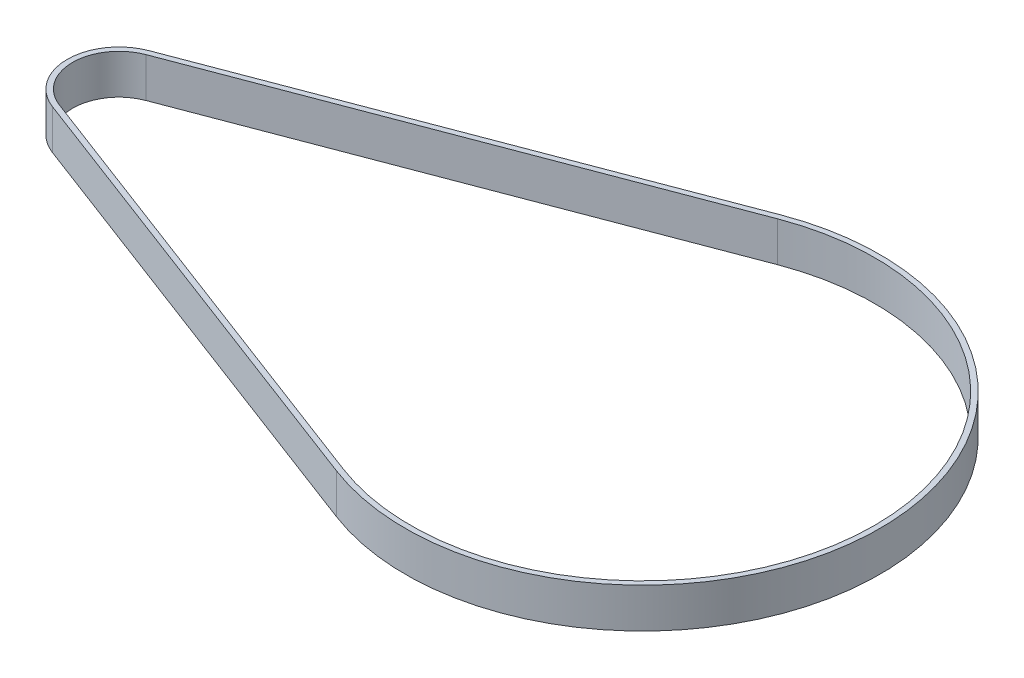
ISO-10303-21;
HEADER;
FILE_DESCRIPTION(('STEP AP214'),'2;1');
FILE_NAME('part.step','',(''),(''),'','','');
FILE_SCHEMA(('AUTOMOTIVE_DESIGN { 1 0 10303 214 1 1 1 1 }'));
ENDSEC;
DATA;
#1=APPLICATION_CONTEXT('core data for automotive mechanical design processes');
#2=APPLICATION_PROTOCOL_DEFINITION('international standard','automotive_design',2000,#1);
#3=PRODUCT_CONTEXT('',#1,'mechanical');
#4=PRODUCT('Part','Part','',(#3));
#5=PRODUCT_RELATED_PRODUCT_CATEGORY('part','',(#4));
#6=PRODUCT_DEFINITION_FORMATION('','',#4);
#7=PRODUCT_DEFINITION_CONTEXT('part definition',#1,'design');
#8=PRODUCT_DEFINITION('design','',#6,#7);
#9=PRODUCT_DEFINITION_SHAPE('','',#8);
#10=(LENGTH_UNIT() NAMED_UNIT(*) SI_UNIT(.MILLI.,.METRE.));
#11=(NAMED_UNIT(*) PLANE_ANGLE_UNIT() SI_UNIT($,.RADIAN.));
#12=(NAMED_UNIT(*) SI_UNIT($,.STERADIAN.) SOLID_ANGLE_UNIT());
#13=UNCERTAINTY_MEASURE_WITH_UNIT(LENGTH_MEASURE(1.E-05),#10,'distance_accuracy_value','');
#14=(GEOMETRIC_REPRESENTATION_CONTEXT(3) GLOBAL_UNCERTAINTY_ASSIGNED_CONTEXT((#13)) GLOBAL_UNIT_ASSIGNED_CONTEXT((#10,
#11,#12)) REPRESENTATION_CONTEXT('',''));
#15=CARTESIAN_POINT('',(0.,0.,0.));
#16=DIRECTION('',(0.,0.,1.));
#17=DIRECTION('',(1.,0.,0.));
#18=AXIS2_PLACEMENT_3D('',#15,#16,#17);
#19=CARTESIAN_POINT('',(-79.,6.,0.));
#20=DIRECTION('',(0.,1.,0.));
#21=DIRECTION('',(0.,0.,1.));
#22=AXIS2_PLACEMENT_3D('',#19,#20,#21);
#23=PLANE('',#22);
#24=CARTESIAN_POINT('',(-79.,6.,0.));
#25=DIRECTION('',(0.,1.,0.));
#26=DIRECTION('',(0.,0.,1.));
#27=AXIS2_PLACEMENT_3D('',#24,#25,#26);
#28=CIRCLE('',#27,7.8);
#29=CARTESIAN_POINT('',(-81.7645569620253,6.,-7.29364276639028));
#30=VERTEX_POINT('',#29);
#31=CARTESIAN_POINT('',(-81.7645569620253,6.,7.29364276639028));
#32=VERTEX_POINT('',#31);
#33=EDGE_CURVE('E133',#30,#32,#28,.T.);
#34=ORIENTED_EDGE('',*,*,#33,.T.);
#35=DIRECTION('',(0.935082405947472,0.,0.354430379746835));
#36=VECTOR('',#35,1.);
#37=CARTESIAN_POINT('',(-81.7645569620253,6.,7.29364276639028));
#38=LINE('',#37,#36);
#39=CARTESIAN_POINT('',(-12.6886075949367,6.,33.4759501329195));
#40=VERTEX_POINT('',#39);
#41=EDGE_CURVE('E136',#32,#40,#38,.T.);
#42=ORIENTED_EDGE('',*,*,#41,.T.);
#43=CARTESIAN_POINT('',(0.,6.,0.));
#44=DIRECTION('',(0.,1.,0.));
#45=DIRECTION('',(0.,0.,1.));
#46=AXIS2_PLACEMENT_3D('',#43,#44,#45);
#47=CIRCLE('',#46,35.8);
#48=CARTESIAN_POINT('',(-12.6886075949367,6.,-33.4759501329195));
#49=VERTEX_POINT('',#48);
#50=EDGE_CURVE('E139',#40,#49,#47,.T.);
#51=ORIENTED_EDGE('',*,*,#50,.T.);
#52=DIRECTION('',(-0.935082405947473,0.,0.354430379746836));
#53=VECTOR('',#52,1.);
#54=CARTESIAN_POINT('',(-81.7645569620253,6.,-7.29364276639028));
#55=LINE('',#54,#53);
#56=EDGE_CURVE('E141',#49,#30,#55,.T.);
#57=ORIENTED_EDGE('',*,*,#56,.T.);
#58=EDGE_LOOP('',(#34,#42,#51,#57));
#59=FACE_BOUND('',#58,.T.);
#60=DIRECTION('',(0.935082405947472,0.,0.354430379746836));
#61=VECTOR('',#60,1.);
#62=CARTESIAN_POINT('',(-81.4810126582279,6.,6.54557684163231));
#63=LINE('',#62,#61);
#64=CARTESIAN_POINT('',(-81.4810126582279,6.,6.54557684163231));
#65=VERTEX_POINT('',#64);
#66=CARTESIAN_POINT('',(-12.4050632911392,6.,32.7278842081616));
#67=VERTEX_POINT('',#66);
#68=EDGE_CURVE('E105',#65,#67,#63,.T.);
#69=ORIENTED_EDGE('',*,*,#68,.F.);
#70=CARTESIAN_POINT('',(-79.,6.,0.));
#71=DIRECTION('',(0.,1.,0.));
#72=DIRECTION('',(0.,0.,1.));
#73=AXIS2_PLACEMENT_3D('',#70,#71,#72);
#74=CIRCLE('',#73,7.);
#75=CARTESIAN_POINT('',(-81.4810126582279,6.,-6.5455768416323));
#76=VERTEX_POINT('',#75);
#77=EDGE_CURVE('E97',#76,#65,#74,.T.);
#78=ORIENTED_EDGE('',*,*,#77,.F.);
#79=DIRECTION('',(-0.935082405947473,0.,0.354430379746835));
#80=VECTOR('',#79,1.);
#81=CARTESIAN_POINT('',(-81.4810126582279,6.,-6.5455768416323));
#82=LINE('',#81,#80);
#83=CARTESIAN_POINT('',(-12.4050632911392,6.,-32.7278842081615));
#84=VERTEX_POINT('',#83);
#85=EDGE_CURVE('E119',#84,#76,#82,.T.);
#86=ORIENTED_EDGE('',*,*,#85,.F.);
#87=CARTESIAN_POINT('',(0.,6.,0.));
#88=DIRECTION('',(0.,1.,0.));
#89=DIRECTION('',(0.,0.,1.));
#90=AXIS2_PLACEMENT_3D('',#87,#88,#89);
#91=CIRCLE('',#90,35.);
#92=EDGE_CURVE('E117',#67,#84,#91,.T.);
#93=ORIENTED_EDGE('',*,*,#92,.F.);
#94=EDGE_LOOP('',(#69,#78,#86,#93));
#95=FACE_BOUND('',#94,.T.);
#96=ADVANCED_FACE('F32',(#59,#95),#23,.T.);
#97=CARTESIAN_POINT('',(-79.,0.,0.));
#98=DIRECTION('',(0.,1.,0.));
#99=DIRECTION('',(0.,0.,1.));
#100=AXIS2_PLACEMENT_3D('',#97,#98,#99);
#101=PLANE('',#100);
#102=CARTESIAN_POINT('',(-79.,0.,0.));
#103=DIRECTION('',(0.,1.,0.));
#104=DIRECTION('',(0.,0.,1.));
#105=AXIS2_PLACEMENT_3D('',#102,#103,#104);
#106=CIRCLE('',#105,7.8);
#107=CARTESIAN_POINT('',(-81.7645569620253,0.,-7.29364276639028));
#108=VERTEX_POINT('',#107);
#109=CARTESIAN_POINT('',(-81.7645569620253,0.,7.29364276639028));
#110=VERTEX_POINT('',#109);
#111=EDGE_CURVE('E113',#108,#110,#106,.T.);
#112=ORIENTED_EDGE('',*,*,#111,.F.);
#113=DIRECTION('',(-0.935082405947473,0.,0.354430379746836));
#114=VECTOR('',#113,1.);
#115=CARTESIAN_POINT('',(-81.7645569620253,0.,-7.29364276639028));
#116=LINE('',#115,#114);
#117=CARTESIAN_POINT('',(-12.6886075949367,0.,-33.4759501329195));
#118=VERTEX_POINT('',#117);
#119=EDGE_CURVE('E137',#118,#108,#116,.T.);
#120=ORIENTED_EDGE('',*,*,#119,.F.);
#121=CARTESIAN_POINT('',(0.,0.,0.));
#122=DIRECTION('',(0.,1.,0.));
#123=DIRECTION('',(0.,0.,1.));
#124=AXIS2_PLACEMENT_3D('',#121,#122,#123);
#125=CIRCLE('',#124,35.8);
#126=CARTESIAN_POINT('',(-12.6886075949367,0.,33.4759501329195));
#127=VERTEX_POINT('',#126);
#128=EDGE_CURVE('E148',#127,#118,#125,.T.);
#129=ORIENTED_EDGE('',*,*,#128,.F.);
#130=DIRECTION('',(0.935082405947472,0.,0.354430379746835));
#131=VECTOR('',#130,1.);
#132=CARTESIAN_POINT('',(-81.7645569620253,0.,7.29364276639028));
#133=LINE('',#132,#131);
#134=EDGE_CURVE('E146',#110,#127,#133,.T.);
#135=ORIENTED_EDGE('',*,*,#134,.F.);
#136=EDGE_LOOP('',(#112,#120,#129,#135));
#137=FACE_BOUND('',#136,.T.);
#138=CARTESIAN_POINT('',(-79.,0.,0.));
#139=DIRECTION('',(0.,1.,0.));
#140=DIRECTION('',(0.,0.,1.));
#141=AXIS2_PLACEMENT_3D('',#138,#139,#140);
#142=CIRCLE('',#141,7.);
#143=CARTESIAN_POINT('',(-81.4810126582279,0.,-6.5455768416323));
#144=VERTEX_POINT('',#143);
#145=CARTESIAN_POINT('',(-81.4810126582279,0.,6.54557684163231));
#146=VERTEX_POINT('',#145);
#147=EDGE_CURVE('E55',#144,#146,#142,.T.);
#148=ORIENTED_EDGE('',*,*,#147,.T.);
#149=DIRECTION('',(0.935082405947472,0.,0.354430379746836));
#150=VECTOR('',#149,1.);
#151=CARTESIAN_POINT('',(-81.4810126582279,0.,6.54557684163231));
#152=LINE('',#151,#150);
#153=CARTESIAN_POINT('',(-12.4050632911392,0.,32.7278842081616));
#154=VERTEX_POINT('',#153);
#155=EDGE_CURVE('E112',#146,#154,#152,.T.);
#156=ORIENTED_EDGE('',*,*,#155,.T.);
#157=CARTESIAN_POINT('',(0.,0.,0.));
#158=DIRECTION('',(0.,1.,0.));
#159=DIRECTION('',(0.,0.,1.));
#160=AXIS2_PLACEMENT_3D('',#157,#158,#159);
#161=CIRCLE('',#160,35.);
#162=CARTESIAN_POINT('',(-12.4050632911392,0.,-32.7278842081616));
#163=VERTEX_POINT('',#162);
#164=EDGE_CURVE('E125',#154,#163,#161,.T.);
#165=ORIENTED_EDGE('',*,*,#164,.T.);
#166=DIRECTION('',(-0.935082405947473,0.,0.354430379746835));
#167=VECTOR('',#166,1.);
#168=CARTESIAN_POINT('',(-81.4810126582279,0.,-6.5455768416323));
#169=LINE('',#168,#167);
#170=EDGE_CURVE('E106',#163,#144,#169,.T.);
#171=ORIENTED_EDGE('',*,*,#170,.T.);
#172=EDGE_LOOP('',(#148,#156,#165,#171));
#173=FACE_BOUND('',#172,.T.);
#174=ADVANCED_FACE('F166',(#137,#173),#101,.F.);
#175=CARTESIAN_POINT('',(-79.,6.,0.));
#176=DIRECTION('',(0.,-1.,0.));
#177=DIRECTION('',(0.,0.,-1.));
#178=AXIS2_PLACEMENT_3D('',#175,#176,#177);
#179=CYLINDRICAL_SURFACE('',#178,7.8);
#180=ORIENTED_EDGE('',*,*,#111,.T.);
#181=DIRECTION('',(0.,-1.,0.));
#182=VECTOR('',#181,1.);
#183=CARTESIAN_POINT('',(-81.7645569620253,6.,7.29364276639028));
#184=LINE('',#183,#182);
#185=EDGE_CURVE('E11',#32,#110,#184,.T.);
#186=ORIENTED_EDGE('',*,*,#185,.F.);
#187=ORIENTED_EDGE('',*,*,#33,.F.);
#188=DIRECTION('',(0.,-1.,0.));
#189=VECTOR('',#188,1.);
#190=CARTESIAN_POINT('',(-81.7645569620253,6.,-7.29364276639028));
#191=LINE('',#190,#189);
#192=EDGE_CURVE('E143',#30,#108,#191,.T.);
#193=ORIENTED_EDGE('',*,*,#192,.T.);
#194=EDGE_LOOP('',(#180,#186,#187,#193));
#195=FACE_BOUND('',#194,.T.);
#196=ADVANCED_FACE('F34',(#195),#179,.T.);
#197=CARTESIAN_POINT('',(-81.7645569620253,6.,7.29364276639028));
#198=DIRECTION('',(0.354430379746836,0.,-0.935082405947473));
#199=DIRECTION('',(-0.935082405947473,0.,-0.354430379746836));
#200=AXIS2_PLACEMENT_3D('',#197,#198,#199);
#201=PLANE('',#200);
#202=ORIENTED_EDGE('',*,*,#134,.T.);
#203=DIRECTION('',(0.,-1.,0.));
#204=VECTOR('',#203,1.);
#205=CARTESIAN_POINT('',(-12.6886075949367,6.,33.4759501329195));
#206=LINE('',#205,#204);
#207=EDGE_CURVE('E40',#40,#127,#206,.T.);
#208=ORIENTED_EDGE('',*,*,#207,.F.);
#209=ORIENTED_EDGE('',*,*,#41,.F.);
#210=ORIENTED_EDGE('',*,*,#185,.T.);
#211=EDGE_LOOP('',(#202,#208,#209,#210));
#212=FACE_BOUND('',#211,.T.);
#213=ADVANCED_FACE('F176',(#212),#201,.F.);
#214=CARTESIAN_POINT('',(0.,6.,0.));
#215=DIRECTION('',(0.,-1.,0.));
#216=DIRECTION('',(0.,0.,-1.));
#217=AXIS2_PLACEMENT_3D('',#214,#215,#216);
#218=CYLINDRICAL_SURFACE('',#217,35.8);
#219=ORIENTED_EDGE('',*,*,#128,.T.);
#220=DIRECTION('',(0.,-1.,0.));
#221=VECTOR('',#220,1.);
#222=CARTESIAN_POINT('',(-12.6886075949367,6.,-33.4759501329195));
#223=LINE('',#222,#221);
#224=EDGE_CURVE('E153',#49,#118,#223,.T.);
#225=ORIENTED_EDGE('',*,*,#224,.F.);
#226=ORIENTED_EDGE('',*,*,#50,.F.);
#227=ORIENTED_EDGE('',*,*,#207,.T.);
#228=EDGE_LOOP('',(#219,#225,#226,#227));
#229=FACE_BOUND('',#228,.T.);
#230=ADVANCED_FACE('F160',(#229),#218,.T.);
#231=CARTESIAN_POINT('',(-81.7645569620253,6.,-7.29364276639028));
#232=DIRECTION('',(0.354430379746835,0.,0.935082405947472));
#233=DIRECTION('',(0.935082405947473,0.,-0.354430379746836));
#234=AXIS2_PLACEMENT_3D('',#231,#232,#233);
#235=PLANE('',#234);
#236=ORIENTED_EDGE('',*,*,#119,.T.);
#237=ORIENTED_EDGE('',*,*,#192,.F.);
#238=ORIENTED_EDGE('',*,*,#56,.F.);
#239=ORIENTED_EDGE('',*,*,#224,.T.);
#240=EDGE_LOOP('',(#236,#237,#238,#239));
#241=FACE_BOUND('',#240,.T.);
#242=ADVANCED_FACE('F170',(#241),#235,.F.);
#243=CARTESIAN_POINT('',(-79.,6.,0.));
#244=DIRECTION('',(0.,-1.,0.));
#245=DIRECTION('',(0.,0.,-1.));
#246=AXIS2_PLACEMENT_3D('',#243,#244,#245);
#247=CYLINDRICAL_SURFACE('',#246,7.);
#248=ORIENTED_EDGE('',*,*,#147,.F.);
#249=DIRECTION('',(0.,-1.,0.));
#250=VECTOR('',#249,1.);
#251=CARTESIAN_POINT('',(-81.4810126582279,6.,-6.5455768416323));
#252=LINE('',#251,#250);
#253=EDGE_CURVE('E101',#76,#144,#252,.T.);
#254=ORIENTED_EDGE('',*,*,#253,.F.);
#255=ORIENTED_EDGE('',*,*,#77,.T.);
#256=DIRECTION('',(0.,-1.,0.));
#257=VECTOR('',#256,1.);
#258=CARTESIAN_POINT('',(-81.4810126582279,6.,6.54557684163231));
#259=LINE('',#258,#257);
#260=EDGE_CURVE('E100',#65,#146,#259,.T.);
#261=ORIENTED_EDGE('',*,*,#260,.T.);
#262=EDGE_LOOP('',(#248,#254,#255,#261));
#263=FACE_BOUND('',#262,.T.);
#264=ADVANCED_FACE('F99',(#263),#247,.F.);
#265=CARTESIAN_POINT('',(-81.4810126582279,6.,6.54557684163231));
#266=DIRECTION('',(0.354430379746836,0.,-0.935082405947472));
#267=DIRECTION('',(-0.935082405947473,0.,-0.354430379746836));
#268=AXIS2_PLACEMENT_3D('',#265,#266,#267);
#269=PLANE('',#268);
#270=ORIENTED_EDGE('',*,*,#155,.F.);
#271=ORIENTED_EDGE('',*,*,#260,.F.);
#272=ORIENTED_EDGE('',*,*,#68,.T.);
#273=DIRECTION('',(0.,-1.,0.));
#274=VECTOR('',#273,1.);
#275=CARTESIAN_POINT('',(-12.4050632911392,6.,32.7278842081616));
#276=LINE('',#275,#274);
#277=EDGE_CURVE('E114',#67,#154,#276,.T.);
#278=ORIENTED_EDGE('',*,*,#277,.T.);
#279=EDGE_LOOP('',(#270,#271,#272,#278));
#280=FACE_BOUND('',#279,.T.);
#281=ADVANCED_FACE('F109',(#280),#269,.T.);
#282=CARTESIAN_POINT('',(0.,6.,0.));
#283=DIRECTION('',(0.,-1.,0.));
#284=DIRECTION('',(0.,0.,-1.));
#285=AXIS2_PLACEMENT_3D('',#282,#283,#284);
#286=CYLINDRICAL_SURFACE('',#285,35.);
#287=ORIENTED_EDGE('',*,*,#164,.F.);
#288=ORIENTED_EDGE('',*,*,#277,.F.);
#289=ORIENTED_EDGE('',*,*,#92,.T.);
#290=DIRECTION('',(0.,-1.,0.));
#291=VECTOR('',#290,1.);
#292=CARTESIAN_POINT('',(-12.4050632911392,6.,-32.7278842081616));
#293=LINE('',#292,#291);
#294=EDGE_CURVE('E47',#84,#163,#293,.T.);
#295=ORIENTED_EDGE('',*,*,#294,.T.);
#296=EDGE_LOOP('',(#287,#288,#289,#295));
#297=FACE_BOUND('',#296,.T.);
#298=ADVANCED_FACE('F199',(#297),#286,.F.);
#299=CARTESIAN_POINT('',(-81.4810126582279,6.,-6.5455768416323));
#300=DIRECTION('',(0.354430379746835,0.,0.935082405947473));
#301=DIRECTION('',(0.935082405947473,0.,-0.354430379746835));
#302=AXIS2_PLACEMENT_3D('',#299,#300,#301);
#303=PLANE('',#302);
#304=ORIENTED_EDGE('',*,*,#170,.F.);
#305=ORIENTED_EDGE('',*,*,#294,.F.);
#306=ORIENTED_EDGE('',*,*,#85,.T.);
#307=ORIENTED_EDGE('',*,*,#253,.T.);
#308=EDGE_LOOP('',(#304,#305,#306,#307));
#309=FACE_BOUND('',#308,.T.);
#310=ADVANCED_FACE('F203',(#309),#303,.T.);
#311=CLOSED_SHELL('',(#96,#174,#196,#213,#230,#242,#264,#281,#298,#310));
#312=MANIFOLD_SOLID_BREP('B2',#311);
#313=ADVANCED_BREP_SHAPE_REPRESENTATION('',(#18,#312),#14);
#314=SHAPE_DEFINITION_REPRESENTATION(#9,#313);
ENDSEC;
END-ISO-10303-21;
